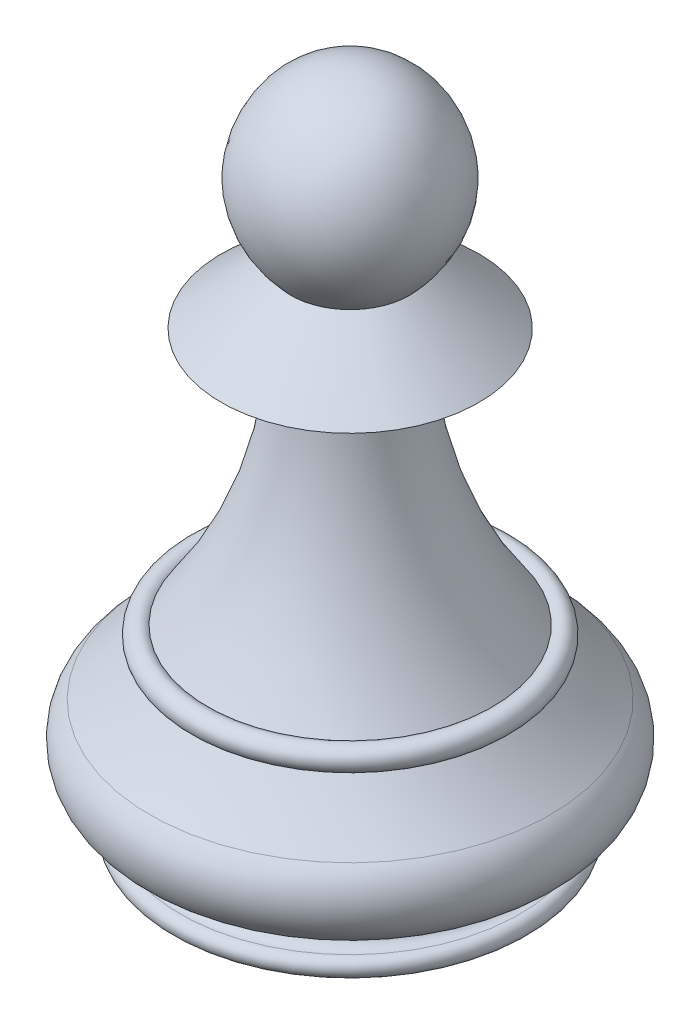
ISO-10303-21;
HEADER;
FILE_DESCRIPTION(('STEP AP214'),'2;1');
FILE_NAME('part.step','',(''),(''),'','','');
FILE_SCHEMA(('AUTOMOTIVE_DESIGN { 1 0 10303 214 1 1 1 1 }'));
ENDSEC;
DATA;
#1=APPLICATION_CONTEXT('core data for automotive mechanical design processes');
#2=APPLICATION_PROTOCOL_DEFINITION('international standard','automotive_design',2000,#1);
#3=PRODUCT_CONTEXT('',#1,'mechanical');
#4=PRODUCT('Part','Part','',(#3));
#5=PRODUCT_RELATED_PRODUCT_CATEGORY('part','',(#4));
#6=PRODUCT_DEFINITION_FORMATION('','',#4);
#7=PRODUCT_DEFINITION_CONTEXT('part definition',#1,'design');
#8=PRODUCT_DEFINITION('design','',#6,#7);
#9=PRODUCT_DEFINITION_SHAPE('','',#8);
#10=(LENGTH_UNIT() NAMED_UNIT(*) SI_UNIT(.MILLI.,.METRE.));
#11=(NAMED_UNIT(*) PLANE_ANGLE_UNIT() SI_UNIT($,.RADIAN.));
#12=(NAMED_UNIT(*) SI_UNIT($,.STERADIAN.) SOLID_ANGLE_UNIT());
#13=UNCERTAINTY_MEASURE_WITH_UNIT(LENGTH_MEASURE(1.E-05),#10,'distance_accuracy_value','');
#14=(GEOMETRIC_REPRESENTATION_CONTEXT(3) GLOBAL_UNCERTAINTY_ASSIGNED_CONTEXT((#13)) GLOBAL_UNIT_ASSIGNED_CONTEXT((#10,
#11,#12)) REPRESENTATION_CONTEXT('',''));
#15=CARTESIAN_POINT('',(0.,0.,0.));
#16=DIRECTION('',(0.,0.,1.));
#17=DIRECTION('',(1.,0.,0.));
#18=AXIS2_PLACEMENT_3D('',#15,#16,#17);
#19=CARTESIAN_POINT('',(0.,0.,0.));
#20=DIRECTION('',(0.,-1.,0.));
#21=DIRECTION('',(0.,0.,-1.));
#22=AXIS2_PLACEMENT_3D('',#19,#20,#21);
#23=PLANE('',#22);
#24=CARTESIAN_POINT('',(0.,0.,0.));
#25=DIRECTION('',(0.,-1.,0.));
#26=DIRECTION('',(0.,0.,-1.));
#27=AXIS2_PLACEMENT_3D('',#24,#25,#26);
#28=CIRCLE('',#27,7.5);
#29=CARTESIAN_POINT('',(0.,0.,-7.5));
#30=VERTEX_POINT('',#29);
#31=EDGE_CURVE('E11',#30,#30,#28,.T.);
#32=ORIENTED_EDGE('',*,*,#31,.T.);
#33=EDGE_LOOP('',(#32));
#34=FACE_BOUND('',#33,.T.);
#35=ADVANCED_FACE('F38',(#34),#23,.T.);
#36=CARTESIAN_POINT('',(0.,0.4,0.));
#37=DIRECTION('',(0.,-1.,0.));
#38=DIRECTION('',(0.,0.,-1.));
#39=AXIS2_PLACEMENT_3D('',#36,#37,#38);
#40=TOROIDAL_SURFACE('',#39,7.5,0.4);
#41=CARTESIAN_POINT('',(0.,0.8,0.));
#42=DIRECTION('',(0.,-1.,0.));
#43=DIRECTION('',(0.,0.,-1.));
#44=AXIS2_PLACEMENT_3D('',#41,#42,#43);
#45=CIRCLE('',#44,7.5);
#46=CARTESIAN_POINT('',(0.,0.8,-7.5));
#47=VERTEX_POINT('',#46);
#48=EDGE_CURVE('E44',#47,#47,#45,.T.);
#49=ORIENTED_EDGE('',*,*,#48,.T.);
#50=EDGE_LOOP('',(#49));
#51=FACE_BOUND('',#50,.T.);
#52=ORIENTED_EDGE('',*,*,#31,.F.);
#53=EDGE_LOOP('',(#52));
#54=FACE_BOUND('',#53,.T.);
#55=ADVANCED_FACE('F82',(#51,#54),#40,.T.);
#56=CARTESIAN_POINT('',(0.,1.3,0.));
#57=DIRECTION('',(0.,-1.,0.));
#58=DIRECTION('',(0.,0.,-1.));
#59=AXIS2_PLACEMENT_3D('',#56,#57,#58);
#60=TOROIDAL_SURFACE('',#59,7.5,0.5);
#61=CARTESIAN_POINT('',(0.,1.8,0.));
#62=DIRECTION('',(0.,-1.,0.));
#63=DIRECTION('',(0.,0.,-1.));
#64=AXIS2_PLACEMENT_3D('',#61,#62,#63);
#65=CIRCLE('',#64,7.5);
#66=CARTESIAN_POINT('',(0.,1.8,-7.5));
#67=VERTEX_POINT('',#66);
#68=EDGE_CURVE('E77',#67,#67,#65,.T.);
#69=ORIENTED_EDGE('',*,*,#68,.T.);
#70=EDGE_LOOP('',(#69));
#71=FACE_BOUND('',#70,.T.);
#72=ORIENTED_EDGE('',*,*,#48,.F.);
#73=EDGE_LOOP('',(#72));
#74=FACE_BOUND('',#73,.T.);
#75=ADVANCED_FACE('F85',(#71,#74),#60,.F.);
#76=CARTESIAN_POINT('',(0.,3.8,0.));
#77=DIRECTION('',(0.,-1.,0.));
#78=DIRECTION('',(0.,0.,-1.));
#79=AXIS2_PLACEMENT_3D('',#76,#77,#78);
#80=TOROIDAL_SURFACE('',#79,7.5,2.);
#81=CARTESIAN_POINT('',(0.,5.27563545633737,0.));
#82=DIRECTION('',(0.,-1.,0.));
#83=DIRECTION('',(0.,0.,-1.));
#84=AXIS2_PLACEMENT_3D('',#81,#82,#83);
#85=CIRCLE('',#84,8.84999999999999);
#86=CARTESIAN_POINT('',(0.,5.27563545633737,-8.84999999999999));
#87=VERTEX_POINT('',#86);
#88=EDGE_CURVE('E74',#87,#87,#85,.T.);
#89=ORIENTED_EDGE('',*,*,#88,.T.);
#90=EDGE_LOOP('',(#89));
#91=FACE_BOUND('',#90,.T.);
#92=ORIENTED_EDGE('',*,*,#68,.F.);
#93=EDGE_LOOP('',(#92));
#94=FACE_BOUND('',#93,.T.);
#95=ADVANCED_FACE('F87',(#91,#94),#80,.T.);
#96=CARTESIAN_POINT('',(0.,19.4933830781479,0.));
#97=DIRECTION('',(0.,-1.,0.));
#98=DIRECTION('',(0.,0.,-1.));
#99=AXIS2_PLACEMENT_3D('',#96,#97,#98);
#100=TOROIDAL_SURFACE('',#99,21.85725,19.27);
#101=CARTESIAN_POINT('',(0.,7.34375047310591,0.));
#102=DIRECTION('',(0.,-1.,0.));
#103=DIRECTION('',(0.,0.,-1.));
#104=AXIS2_PLACEMENT_3D('',#101,#102,#103);
#105=CIRCLE('',#104,6.9);
#106=CARTESIAN_POINT('',(0.,7.34375047310591,-6.9));
#107=VERTEX_POINT('',#106);
#108=EDGE_CURVE('E71',#107,#107,#105,.T.);
#109=ORIENTED_EDGE('',*,*,#108,.T.);
#110=EDGE_LOOP('',(#109));
#111=FACE_BOUND('',#110,.T.);
#112=ORIENTED_EDGE('',*,*,#88,.F.);
#113=EDGE_LOOP('',(#112));
#114=FACE_BOUND('',#113,.T.);
#115=ADVANCED_FACE('F94',(#111,#114),#100,.F.);
#116=CARTESIAN_POINT('',(0.,7.76171208599058,0.));
#117=DIRECTION('',(0.,-1.,0.));
#118=DIRECTION('',(0.,0.,-1.));
#119=AXIS2_PLACEMENT_3D('',#116,#117,#118);
#120=TOROIDAL_SURFACE('',#119,6.62557680463407,0.5);
#121=CARTESIAN_POINT('',(0.,8.1337504731059,0.));
#122=DIRECTION('',(0.,-1.,0.));
#123=DIRECTION('',(0.,0.,-1.));
#124=AXIS2_PLACEMENT_3D('',#121,#122,#123);
#125=CIRCLE('',#124,6.2915297443078);
#126=CARTESIAN_POINT('',(0.,8.1337504731059,-6.2915297443078));
#127=VERTEX_POINT('',#126);
#128=EDGE_CURVE('E68',#127,#127,#125,.T.);
#129=ORIENTED_EDGE('',*,*,#128,.T.);
#130=EDGE_LOOP('',(#129));
#131=FACE_BOUND('',#130,.T.);
#132=ORIENTED_EDGE('',*,*,#108,.F.);
#133=EDGE_LOOP('',(#132));
#134=FACE_BOUND('',#133,.T.);
#135=ADVANCED_FACE('F128',(#131,#134),#120,.T.);
#136=CARTESIAN_POINT('',(0.,19.4933830781479,0.));
#137=DIRECTION('',(0.,-1.,0.));
#138=DIRECTION('',(0.,0.,-1.));
#139=AXIS2_PLACEMENT_3D('',#136,#137,#138);
#140=TOROIDAL_SURFACE('',#139,21.85725,19.27);
#141=CARTESIAN_POINT('',(0.,19.4933830781479,0.));
#142=DIRECTION('',(0.,-1.,0.));
#143=DIRECTION('',(0.,0.,-1.));
#144=AXIS2_PLACEMENT_3D('',#141,#142,#143);
#145=CIRCLE('',#144,2.58725);
#146=CARTESIAN_POINT('',(0.,19.4933830781479,-2.58725));
#147=VERTEX_POINT('',#146);
#148=EDGE_CURVE('E59',#147,#147,#145,.T.);
#149=ORIENTED_EDGE('',*,*,#148,.T.);
#150=EDGE_LOOP('',(#149));
#151=FACE_BOUND('',#150,.T.);
#152=ORIENTED_EDGE('',*,*,#128,.F.);
#153=EDGE_LOOP('',(#152));
#154=FACE_BOUND('',#153,.T.);
#155=ADVANCED_FACE('F139',(#151,#154),#140,.F.);
#156=CARTESIAN_POINT('',(2.58725,19.4933830781479,0.));
#157=DIRECTION('',(0.,-1.,0.));
#158=DIRECTION('',(0.,0.,-1.));
#159=AXIS2_PLACEMENT_3D('',#156,#157,#158);
#160=PLANE('',#159);
#161=CARTESIAN_POINT('',(0.,19.4933830781479,0.));
#162=DIRECTION('',(0.,-1.,0.));
#163=DIRECTION('',(0.,0.,-1.));
#164=AXIS2_PLACEMENT_3D('',#161,#162,#163);
#165=CIRCLE('',#164,5.69725);
#166=CARTESIAN_POINT('',(0.,19.4933830781479,-5.69725));
#167=VERTEX_POINT('',#166);
#168=EDGE_CURVE('E56',#167,#167,#165,.T.);
#169=ORIENTED_EDGE('',*,*,#168,.T.);
#170=EDGE_LOOP('',(#169));
#171=FACE_BOUND('',#170,.T.);
#172=ORIENTED_EDGE('',*,*,#148,.F.);
#173=EDGE_LOOP('',(#172));
#174=FACE_BOUND('',#173,.T.);
#175=ADVANCED_FACE('F150',(#171,#174),#160,.T.);
#176=CARTESIAN_POINT('',(0.,19.4933830781479,0.));
#177=DIRECTION('',(0.,-1.,0.));
#178=DIRECTION('',(0.,0.,-1.));
#179=AXIS2_PLACEMENT_3D('',#176,#177,#178);
#180=CONICAL_SURFACE('',#179,5.69725,0.876897687677575);
#181=CARTESIAN_POINT('',(0.,22.0533830781479,0.));
#182=DIRECTION('',(0.,-1.,0.));
#183=DIRECTION('',(0.,0.,-1.));
#184=AXIS2_PLACEMENT_3D('',#181,#182,#183);
#185=CIRCLE('',#184,2.62);
#186=CARTESIAN_POINT('',(0.,22.0533830781479,-2.62));
#187=VERTEX_POINT('',#186);
#188=EDGE_CURVE('E54',#187,#187,#185,.T.);
#189=ORIENTED_EDGE('',*,*,#188,.T.);
#190=EDGE_LOOP('',(#189));
#191=FACE_BOUND('',#190,.T.);
#192=ORIENTED_EDGE('',*,*,#168,.F.);
#193=EDGE_LOOP('',(#192));
#194=FACE_BOUND('',#193,.T.);
#195=ADVANCED_FACE('F50',(#191,#194),#180,.T.);
#196=CARTESIAN_POINT('',(2.62,22.0533830781479,0.));
#197=CARTESIAN_POINT('',(3.43267411797813,22.9097170539868,0.));
#198=CARTESIAN_POINT('',(4.98025529780066,25.4982963923042,0.));
#199=CARTESIAN_POINT('',(2.45329353680814,29.42,0.));
#200=CARTESIAN_POINT('',(0.,29.42,0.));
#201=B_SPLINE_CURVE_WITH_KNOTS('',3,(#196,#197,#198,#199,#200),.UNSPECIFIED.,.F.,.F.,(4,1,4),
(0.,0.487461878662631,1.),.UNSPECIFIED.);
#202=CARTESIAN_POINT('',(0.,0.,0.));
#203=DIRECTION('',(0.,-1.,0.));
#204=AXIS1_PLACEMENT('',#202,#203);
#205=SURFACE_OF_REVOLUTION('',#201,#204);
#206=CARTESIAN_POINT('',(0.,29.42,0.));
#207=VERTEX_POINT('',#206);
#208=VERTEX_LOOP('',#207);
#209=FACE_BOUND('',#208,.T.);
#210=ORIENTED_EDGE('',*,*,#188,.F.);
#211=EDGE_LOOP('',(#210));
#212=FACE_BOUND('',#211,.T.);
#213=ADVANCED_FACE('F47',(#209,#212),#205,.F.);
#214=CLOSED_SHELL('',(#35,#55,#75,#95,#115,#135,#155,#175,#195,#213));
#215=MANIFOLD_SOLID_BREP('B2',#214);
#216=ADVANCED_BREP_SHAPE_REPRESENTATION('',(#18,#215),#14);
#217=SHAPE_DEFINITION_REPRESENTATION(#9,#216);
ENDSEC;
END-ISO-10303-21;
